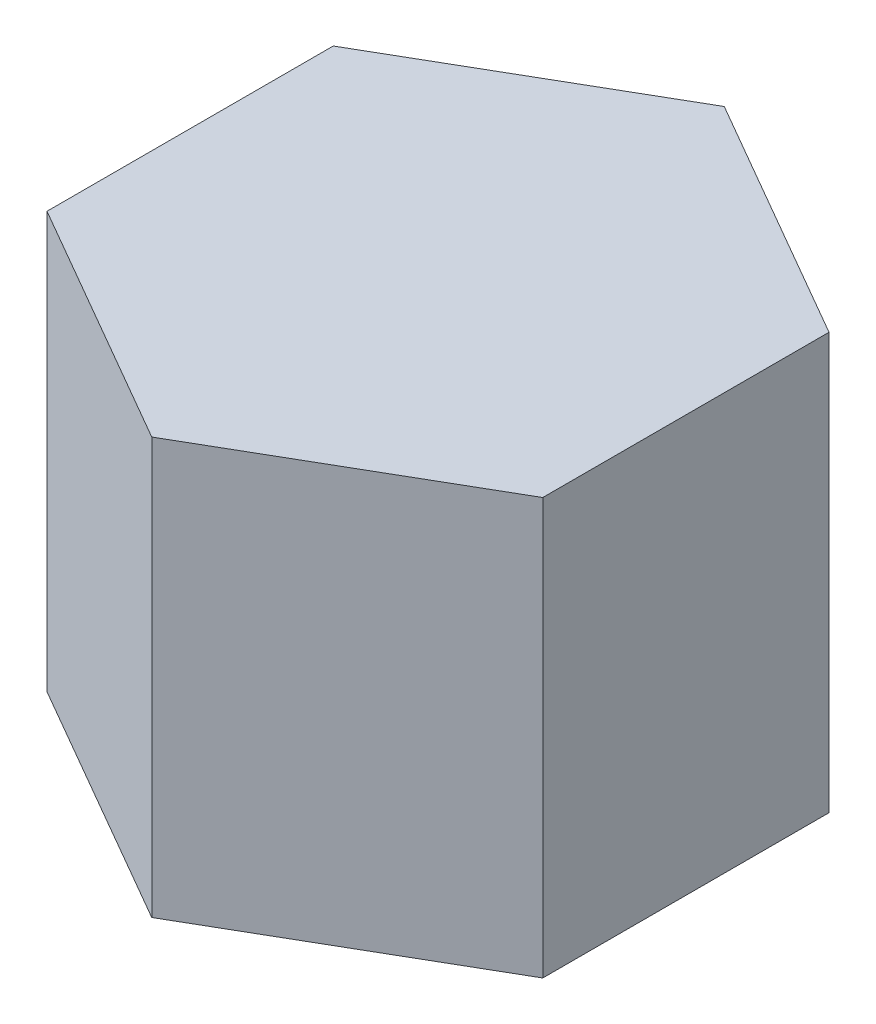
ISO-10303-21;
HEADER;
FILE_DESCRIPTION(('STEP AP214'),'2;1');
FILE_NAME('part.step','',(''),(''),'','','');
FILE_SCHEMA(('AUTOMOTIVE_DESIGN { 1 0 10303 214 1 1 1 1 }'));
ENDSEC;
DATA;
#1=APPLICATION_CONTEXT('core data for automotive mechanical design processes');
#2=APPLICATION_PROTOCOL_DEFINITION('international standard','automotive_design',2000,#1);
#3=PRODUCT_CONTEXT('',#1,'mechanical');
#4=PRODUCT('Part','Part','',(#3));
#5=PRODUCT_RELATED_PRODUCT_CATEGORY('part','',(#4));
#6=PRODUCT_DEFINITION_FORMATION('','',#4);
#7=PRODUCT_DEFINITION_CONTEXT('part definition',#1,'design');
#8=PRODUCT_DEFINITION('design','',#6,#7);
#9=PRODUCT_DEFINITION_SHAPE('','',#8);
#10=(LENGTH_UNIT() NAMED_UNIT(*) SI_UNIT(.MILLI.,.METRE.));
#11=(NAMED_UNIT(*) PLANE_ANGLE_UNIT() SI_UNIT($,.RADIAN.));
#12=(NAMED_UNIT(*) SI_UNIT($,.STERADIAN.) SOLID_ANGLE_UNIT());
#13=UNCERTAINTY_MEASURE_WITH_UNIT(LENGTH_MEASURE(1.E-05),#10,'distance_accuracy_value','');
#14=(GEOMETRIC_REPRESENTATION_CONTEXT(3) GLOBAL_UNCERTAINTY_ASSIGNED_CONTEXT((#13)) GLOBAL_UNIT_ASSIGNED_CONTEXT((#10,
#11,#12)) REPRESENTATION_CONTEXT('',''));
#15=CARTESIAN_POINT('',(0.,0.,0.));
#16=DIRECTION('',(0.,0.,1.));
#17=DIRECTION('',(1.,0.,0.));
#18=AXIS2_PLACEMENT_3D('',#15,#16,#17);
#19=CARTESIAN_POINT('',(207.339551417381,-147.556598747966,295.146072835632));
#20=DIRECTION('',(-0.500000000000062,0.,-0.866025403784403));
#21=DIRECTION('',(-0.866025403784403,0.,0.500000000000062));
#22=AXIS2_PLACEMENT_3D('',#19,#20,#21);
#23=PLANE('',#22);
#24=CARTESIAN_POINT('',(207.642660308706,-147.047793579175,294.971072835632));
#25=DIRECTION('',(-0.866025403784403,0.,0.500000000000062));
#26=VECTOR('',#25,1.);
#27=LINE('',#24,#26);
#28=CARTESIAN_POINT('',(207.642660308706,-147.047793579175,294.971072835632));
#29=VERTEX_POINT('',#28);
#30=CARTESIAN_POINT('',(207.339551417382,-147.047793579175,295.146072835632));
#31=VERTEX_POINT('',#30);
#32=EDGE_CURVE('E170',#29,#31,#27,.T.);
#33=ORIENTED_EDGE('',*,*,#32,.T.);
#34=CARTESIAN_POINT('',(207.339551417382,-147.556598747966,295.146072835632));
#35=DIRECTION('',(0.,1.,0.));
#36=VECTOR('',#35,1.);
#37=LINE('',#34,#36);
#38=CARTESIAN_POINT('',(207.339551417382,-147.556598747966,295.146072835632));
#39=VERTEX_POINT('',#38);
#40=EDGE_CURVE('E35',#39,#31,#37,.T.);
#41=ORIENTED_EDGE('',*,*,#40,.F.);
#42=CARTESIAN_POINT('',(207.642660308706,-147.556598747966,294.971072835632));
#43=DIRECTION('',(-0.866025403784403,0.,0.500000000000062));
#44=VECTOR('',#43,1.);
#45=LINE('',#42,#44);
#46=CARTESIAN_POINT('',(207.642660308706,-147.556598747966,294.971072835632));
#47=VERTEX_POINT('',#46);
#48=EDGE_CURVE('E159',#47,#39,#45,.T.);
#49=ORIENTED_EDGE('',*,*,#48,.F.);
#50=CARTESIAN_POINT('',(207.642660308706,-147.556598747966,294.971072835632));
#51=DIRECTION('',(0.,1.,0.));
#52=VECTOR('',#51,1.);
#53=LINE('',#50,#52);
#54=EDGE_CURVE('E10',#47,#29,#53,.T.);
#55=ORIENTED_EDGE('',*,*,#54,.T.);
#56=EDGE_LOOP('',(#33,#41,#49,#55));
#57=FACE_BOUND('',#56,.T.);
#58=ADVANCED_FACE('F16',(#57),#23,.F.);
#59=CARTESIAN_POINT('',(207.642660308706,-147.556598747966,291.594471220494));
#60=DIRECTION('',(-1.,0.,0.));
#61=DIRECTION('',(0.,-1.,0.));
#62=AXIS2_PLACEMENT_3D('',#59,#60,#61);
#63=PLANE('',#62);
#64=CARTESIAN_POINT('',(207.642660308706,-147.047793579175,294.621072835632));
#65=DIRECTION('',(0.,0.,1.));
#66=VECTOR('',#65,1.);
#67=LINE('',#64,#66);
#68=CARTESIAN_POINT('',(207.642660308706,-147.047793579175,294.621072835632));
#69=VERTEX_POINT('',#68);
#70=EDGE_CURVE('E167',#69,#29,#67,.T.);
#71=ORIENTED_EDGE('',*,*,#70,.T.);
#72=ORIENTED_EDGE('',*,*,#54,.F.);
#73=CARTESIAN_POINT('',(207.642660308706,-147.556598747966,294.621072835632));
#74=DIRECTION('',(0.,0.,1.));
#75=VECTOR('',#74,1.);
#76=LINE('',#73,#75);
#77=CARTESIAN_POINT('',(207.642660308706,-147.556598747966,294.621072835632));
#78=VERTEX_POINT('',#77);
#79=EDGE_CURVE('E156',#78,#47,#76,.T.);
#80=ORIENTED_EDGE('',*,*,#79,.F.);
#81=CARTESIAN_POINT('',(207.642660308706,-147.556598747966,294.621072835632));
#82=DIRECTION('',(0.,1.,0.));
#83=VECTOR('',#82,1.);
#84=LINE('',#81,#83);
#85=EDGE_CURVE('E27',#78,#69,#84,.T.);
#86=ORIENTED_EDGE('',*,*,#85,.T.);
#87=EDGE_LOOP('',(#71,#72,#80,#86));
#88=FACE_BOUND('',#87,.T.);
#89=ADVANCED_FACE('F189',(#88),#63,.F.);
#90=CARTESIAN_POINT('',(207.642660308706,-147.556598747966,294.621072835632));
#91=DIRECTION('',(-0.500000000000012,0.,0.866025403784432));
#92=DIRECTION('',(0.866025403784432,0.,0.500000000000012));
#93=AXIS2_PLACEMENT_3D('',#90,#91,#92);
#94=PLANE('',#93);
#95=CARTESIAN_POINT('',(207.339551417382,-147.047793579175,294.446072835632));
#96=DIRECTION('',(0.866025403784432,0.,0.500000000000012));
#97=VECTOR('',#96,1.);
#98=LINE('',#95,#97);
#99=CARTESIAN_POINT('',(207.339551417382,-147.047793579175,294.446072835632));
#100=VERTEX_POINT('',#99);
#101=EDGE_CURVE('E163',#100,#69,#98,.T.);
#102=ORIENTED_EDGE('',*,*,#101,.T.);
#103=ORIENTED_EDGE('',*,*,#85,.F.);
#104=CARTESIAN_POINT('',(207.339551417382,-147.556598747966,294.446072835632));
#105=DIRECTION('',(0.866025403784432,0.,0.500000000000012));
#106=VECTOR('',#105,1.);
#107=LINE('',#104,#106);
#108=CARTESIAN_POINT('',(207.339551417382,-147.556598747966,294.446072835632));
#109=VERTEX_POINT('',#108);
#110=EDGE_CURVE('E106',#109,#78,#107,.T.);
#111=ORIENTED_EDGE('',*,*,#110,.F.);
#112=CARTESIAN_POINT('',(207.339551417382,-147.556598747966,294.446072835632));
#113=DIRECTION('',(0.,1.,0.));
#114=VECTOR('',#113,1.);
#115=LINE('',#112,#114);
#116=EDGE_CURVE('E94',#109,#100,#115,.T.);
#117=ORIENTED_EDGE('',*,*,#116,.T.);
#118=EDGE_LOOP('',(#102,#103,#111,#117));
#119=FACE_BOUND('',#118,.T.);
#120=ADVANCED_FACE('F198',(#119),#94,.F.);
#121=CARTESIAN_POINT('',(207.339551417382,-147.556598747966,294.446072835632));
#122=DIRECTION('',(0.499999999999978,0.,0.866025403784452));
#123=DIRECTION('',(0.866025403784452,0.,-0.499999999999978));
#124=AXIS2_PLACEMENT_3D('',#121,#122,#123);
#125=PLANE('',#124);
#126=CARTESIAN_POINT('',(207.036442526057,-147.047793579175,294.621072835632));
#127=DIRECTION('',(0.866025403784452,0.,-0.499999999999978));
#128=VECTOR('',#127,1.);
#129=LINE('',#126,#128);
#130=CARTESIAN_POINT('',(207.036442526057,-147.047793579175,294.621072835632));
#131=VERTEX_POINT('',#130);
#132=EDGE_CURVE('E162',#131,#100,#129,.T.);
#133=ORIENTED_EDGE('',*,*,#132,.T.);
#134=ORIENTED_EDGE('',*,*,#116,.F.);
#135=CARTESIAN_POINT('',(207.036442526057,-147.556598747966,294.621072835632));
#136=DIRECTION('',(0.866025403784452,0.,-0.499999999999978));
#137=VECTOR('',#136,1.);
#138=LINE('',#135,#137);
#139=CARTESIAN_POINT('',(207.036442526057,-147.556598747966,294.621072835632));
#140=VERTEX_POINT('',#139);
#141=EDGE_CURVE('E98',#140,#109,#138,.T.);
#142=ORIENTED_EDGE('',*,*,#141,.F.);
#143=CARTESIAN_POINT('',(207.036442526057,-147.556598747966,294.621072835632));
#144=DIRECTION('',(0.,1.,0.));
#145=VECTOR('',#144,1.);
#146=LINE('',#143,#145);
#147=EDGE_CURVE('E79',#140,#131,#146,.T.);
#148=ORIENTED_EDGE('',*,*,#147,.T.);
#149=EDGE_LOOP('',(#133,#134,#142,#148));
#150=FACE_BOUND('',#149,.T.);
#151=ADVANCED_FACE('F100',(#150),#125,.F.);
#152=CARTESIAN_POINT('',(207.036442526057,-147.556598747966,291.594471220494));
#153=DIRECTION('',(1.,0.,0.));
#154=DIRECTION('',(0.,1.,0.));
#155=AXIS2_PLACEMENT_3D('',#152,#153,#154);
#156=PLANE('',#155);
#157=CARTESIAN_POINT('',(207.036442526057,-147.047793579175,294.971072835632));
#158=DIRECTION('',(0.,0.,-1.));
#159=VECTOR('',#158,1.);
#160=LINE('',#157,#159);
#161=CARTESIAN_POINT('',(207.036442526057,-147.047793579175,294.971072835632));
#162=VERTEX_POINT('',#161);
#163=EDGE_CURVE('E88',#162,#131,#160,.T.);
#164=ORIENTED_EDGE('',*,*,#163,.T.);
#165=ORIENTED_EDGE('',*,*,#147,.F.);
#166=CARTESIAN_POINT('',(207.036442526057,-147.556598747966,294.971072835632));
#167=DIRECTION('',(0.,0.,-1.));
#168=VECTOR('',#167,1.);
#169=LINE('',#166,#168);
#170=CARTESIAN_POINT('',(207.036442526057,-147.556598747966,294.971072835632));
#171=VERTEX_POINT('',#170);
#172=EDGE_CURVE('E84',#171,#140,#169,.T.);
#173=ORIENTED_EDGE('',*,*,#172,.F.);
#174=CARTESIAN_POINT('',(207.036442526057,-147.556598747966,294.971072835632));
#175=DIRECTION('',(0.,1.,0.));
#176=VECTOR('',#175,1.);
#177=LINE('',#174,#176);
#178=EDGE_CURVE('E58',#171,#162,#177,.T.);
#179=ORIENTED_EDGE('',*,*,#178,.T.);
#180=EDGE_LOOP('',(#164,#165,#173,#179));
#181=FACE_BOUND('',#180,.T.);
#182=ADVANCED_FACE('F82',(#181),#156,.F.);
#183=CARTESIAN_POINT('',(207.036442526057,-147.556598747966,294.971072835632));
#184=DIRECTION('',(0.500000000000062,0.,-0.866025403784403));
#185=DIRECTION('',(-0.866025403784403,0.,-0.500000000000062));
#186=AXIS2_PLACEMENT_3D('',#183,#184,#185);
#187=PLANE('',#186);
#188=CARTESIAN_POINT('',(207.339551417382,-147.047793579175,295.146072835632));
#189=DIRECTION('',(-0.866025403784403,0.,-0.500000000000062));
#190=VECTOR('',#189,1.);
#191=LINE('',#188,#190);
#192=EDGE_CURVE('E160',#31,#162,#191,.T.);
#193=ORIENTED_EDGE('',*,*,#192,.T.);
#194=ORIENTED_EDGE('',*,*,#178,.F.);
#195=CARTESIAN_POINT('',(207.339551417382,-147.556598747966,295.146072835632));
#196=DIRECTION('',(-0.866025403784403,0.,-0.500000000000062));
#197=VECTOR('',#196,1.);
#198=LINE('',#195,#197);
#199=EDGE_CURVE('E112',#39,#171,#198,.T.);
#200=ORIENTED_EDGE('',*,*,#199,.F.);
#201=ORIENTED_EDGE('',*,*,#40,.T.);
#202=EDGE_LOOP('',(#193,#194,#200,#201));
#203=FACE_BOUND('',#202,.T.);
#204=ADVANCED_FACE('F131',(#203),#187,.F.);
#205=CARTESIAN_POINT('',(206.491105863044,-147.556598747966,291.594471220494));
#206=DIRECTION('',(0.,1.,0.));
#207=DIRECTION('',(-1.,0.,0.));
#208=AXIS2_PLACEMENT_3D('',#205,#206,#207);
#209=PLANE('',#208);
#210=ORIENTED_EDGE('',*,*,#48,.T.);
#211=ORIENTED_EDGE('',*,*,#199,.T.);
#212=ORIENTED_EDGE('',*,*,#172,.T.);
#213=ORIENTED_EDGE('',*,*,#141,.T.);
#214=ORIENTED_EDGE('',*,*,#110,.T.);
#215=ORIENTED_EDGE('',*,*,#79,.T.);
#216=EDGE_LOOP('',(#210,#211,#212,#213,#214,#215));
#217=FACE_BOUND('',#216,.T.);
#218=ADVANCED_FACE('F111',(#217),#209,.F.);
#219=CARTESIAN_POINT('',(206.491105863044,-147.047793579175,291.594471220494));
#220=DIRECTION('',(0.,1.,0.));
#221=DIRECTION('',(-1.,0.,0.));
#222=AXIS2_PLACEMENT_3D('',#219,#220,#221);
#223=PLANE('',#222);
#224=ORIENTED_EDGE('',*,*,#32,.F.);
#225=ORIENTED_EDGE('',*,*,#70,.F.);
#226=ORIENTED_EDGE('',*,*,#101,.F.);
#227=ORIENTED_EDGE('',*,*,#132,.F.);
#228=ORIENTED_EDGE('',*,*,#163,.F.);
#229=ORIENTED_EDGE('',*,*,#192,.F.);
#230=EDGE_LOOP('',(#224,#225,#226,#227,#228,#229));
#231=FACE_BOUND('',#230,.T.);
#232=ADVANCED_FACE('F130',(#231),#223,.T.);
#233=CLOSED_SHELL('',(#58,#89,#120,#151,#182,#204,#218,#232));
#234=MANIFOLD_SOLID_BREP('B1',#233);
#235=ADVANCED_BREP_SHAPE_REPRESENTATION('',(#18,#234),#14);
#236=SHAPE_DEFINITION_REPRESENTATION(#9,#235);
ENDSEC;
END-ISO-10303-21;
